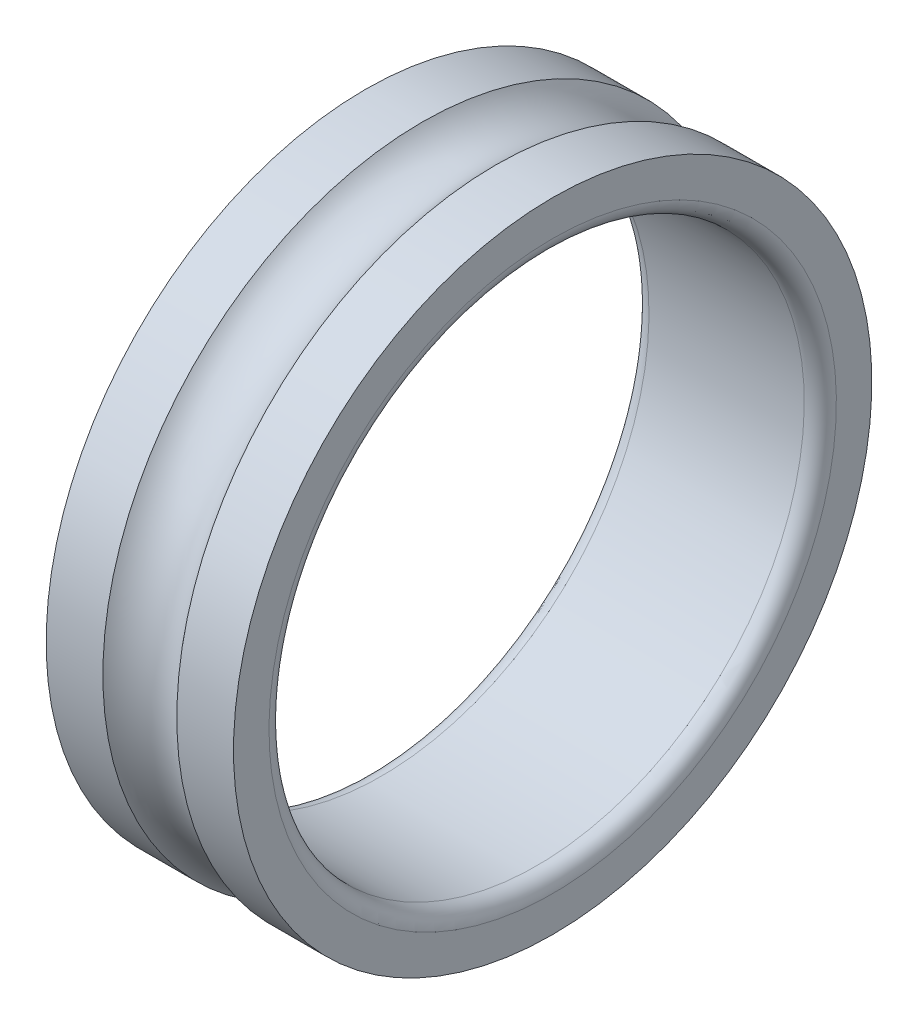
ISO-10303-21;
HEADER;
FILE_DESCRIPTION(('STEP AP214'),'2;1');
FILE_NAME('part.step','',(''),(''),'','','');
FILE_SCHEMA(('AUTOMOTIVE_DESIGN { 1 0 10303 214 1 1 1 1 }'));
ENDSEC;
DATA;
#1=APPLICATION_CONTEXT('core data for automotive mechanical design processes');
#2=APPLICATION_PROTOCOL_DEFINITION('international standard','automotive_design',2000,#1);
#3=PRODUCT_CONTEXT('',#1,'mechanical');
#4=PRODUCT('Part','Part','',(#3));
#5=PRODUCT_RELATED_PRODUCT_CATEGORY('part','',(#4));
#6=PRODUCT_DEFINITION_FORMATION('','',#4);
#7=PRODUCT_DEFINITION_CONTEXT('part definition',#1,'design');
#8=PRODUCT_DEFINITION('design','',#6,#7);
#9=PRODUCT_DEFINITION_SHAPE('','',#8);
#10=(LENGTH_UNIT() NAMED_UNIT(*) SI_UNIT(.MILLI.,.METRE.));
#11=(NAMED_UNIT(*) PLANE_ANGLE_UNIT() SI_UNIT($,.RADIAN.));
#12=(NAMED_UNIT(*) SI_UNIT($,.STERADIAN.) SOLID_ANGLE_UNIT());
#13=UNCERTAINTY_MEASURE_WITH_UNIT(LENGTH_MEASURE(1.E-05),#10,'distance_accuracy_value','');
#14=(GEOMETRIC_REPRESENTATION_CONTEXT(3) GLOBAL_UNCERTAINTY_ASSIGNED_CONTEXT((#13)) GLOBAL_UNIT_ASSIGNED_CONTEXT((#10,
#11,#12)) REPRESENTATION_CONTEXT('',''));
#15=CARTESIAN_POINT('',(0.,0.,0.));
#16=DIRECTION('',(0.,0.,1.));
#17=DIRECTION('',(1.,0.,0.));
#18=AXIS2_PLACEMENT_3D('',#15,#16,#17);
#19=CARTESIAN_POINT('',(5.94044822398207,0.,0.));
#20=DIRECTION('',(-1.,0.,0.));
#21=DIRECTION('',(0.,1.,0.));
#22=AXIS2_PLACEMENT_3D('',#19,#20,#21);
#23=CYLINDRICAL_SURFACE('',#22,11.925);
#24=CARTESIAN_POINT('',(4.88089644796414,0.,0.));
#25=DIRECTION('',(1.,0.,0.));
#26=DIRECTION('',(0.,1.,0.));
#27=AXIS2_PLACEMENT_3D('',#24,#25,#26);
#28=CIRCLE('',#27,11.925);
#29=CARTESIAN_POINT('',(4.88089644796414,11.925,0.));
#30=VERTEX_POINT('',#29);
#31=EDGE_CURVE('E11',#30,#30,#28,.T.);
#32=ORIENTED_EDGE('',*,*,#31,.T.);
#33=EDGE_LOOP('',(#32));
#34=FACE_BOUND('',#33,.T.);
#35=CARTESIAN_POINT('',(7.,0.,0.));
#36=DIRECTION('',(1.,0.,0.));
#37=DIRECTION('',(0.,1.,0.));
#38=AXIS2_PLACEMENT_3D('',#35,#36,#37);
#39=CIRCLE('',#38,11.925);
#40=CARTESIAN_POINT('',(7.,11.925,0.));
#41=VERTEX_POINT('',#40);
#42=EDGE_CURVE('E60',#41,#41,#39,.T.);
#43=ORIENTED_EDGE('',*,*,#42,.F.);
#44=EDGE_LOOP('',(#43));
#45=FACE_BOUND('',#44,.T.);
#46=ADVANCED_FACE('F16',(#34,#45),#23,.T.);
#47=CARTESIAN_POINT('',(3.5,0.,0.));
#48=DIRECTION('',(1.,0.,0.));
#49=DIRECTION('',(0.,0.,-1.));
#50=AXIS2_PLACEMENT_3D('',#47,#48,#49);
#51=TOROIDAL_SURFACE('',#50,13.,1.75);
#52=CARTESIAN_POINT('',(2.11910355203586,0.,0.));
#53=DIRECTION('',(1.,0.,0.));
#54=DIRECTION('',(0.,1.,0.));
#55=AXIS2_PLACEMENT_3D('',#52,#53,#54);
#56=CIRCLE('',#55,11.925);
#57=CARTESIAN_POINT('',(2.11910355203586,11.925,0.));
#58=VERTEX_POINT('',#57);
#59=EDGE_CURVE('E25',#58,#58,#56,.T.);
#60=ORIENTED_EDGE('',*,*,#59,.T.);
#61=EDGE_LOOP('',(#60));
#62=FACE_BOUND('',#61,.T.);
#63=ORIENTED_EDGE('',*,*,#31,.F.);
#64=EDGE_LOOP('',(#63));
#65=FACE_BOUND('',#64,.T.);
#66=ADVANCED_FACE('F86',(#62,#65),#51,.F.);
#67=CARTESIAN_POINT('',(1.05955177601793,0.,0.));
#68=DIRECTION('',(-1.,0.,0.));
#69=DIRECTION('',(0.,1.,0.));
#70=AXIS2_PLACEMENT_3D('',#67,#68,#69);
#71=CYLINDRICAL_SURFACE('',#70,11.925);
#72=CARTESIAN_POINT('',(0.,0.,0.));
#73=DIRECTION('',(1.,0.,0.));
#74=DIRECTION('',(0.,1.,0.));
#75=AXIS2_PLACEMENT_3D('',#72,#73,#74);
#76=CIRCLE('',#75,11.925);
#77=CARTESIAN_POINT('',(0.,11.925,0.));
#78=VERTEX_POINT('',#77);
#79=EDGE_CURVE('E58',#78,#78,#76,.T.);
#80=ORIENTED_EDGE('',*,*,#79,.T.);
#81=EDGE_LOOP('',(#80));
#82=FACE_BOUND('',#81,.T.);
#83=ORIENTED_EDGE('',*,*,#59,.F.);
#84=EDGE_LOOP('',(#83));
#85=FACE_BOUND('',#84,.T.);
#86=ADVANCED_FACE('F91',(#82,#85),#71,.T.);
#87=CARTESIAN_POINT('',(0.,11.2625,0.));
#88=DIRECTION('',(-1.,0.,0.));
#89=DIRECTION('',(0.,-1.,0.));
#90=AXIS2_PLACEMENT_3D('',#87,#88,#89);
#91=PLANE('',#90);
#92=CARTESIAN_POINT('',(0.,0.,0.));
#93=DIRECTION('',(1.,0.,0.));
#94=DIRECTION('',(0.,1.,0.));
#95=AXIS2_PLACEMENT_3D('',#92,#93,#94);
#96=CIRCLE('',#95,10.6);
#97=CARTESIAN_POINT('',(0.,10.6,0.));
#98=VERTEX_POINT('',#97);
#99=EDGE_CURVE('E56',#98,#98,#96,.T.);
#100=ORIENTED_EDGE('',*,*,#99,.T.);
#101=EDGE_LOOP('',(#100));
#102=FACE_BOUND('',#101,.T.);
#103=ORIENTED_EDGE('',*,*,#79,.F.);
#104=EDGE_LOOP('',(#103));
#105=FACE_BOUND('',#104,.T.);
#106=ADVANCED_FACE('F18',(#102,#105),#91,.T.);
#107=CARTESIAN_POINT('',(0.6,0.,0.));
#108=DIRECTION('',(1.,0.,0.));
#109=DIRECTION('',(0.,0.,-1.));
#110=AXIS2_PLACEMENT_3D('',#107,#108,#109);
#111=TOROIDAL_SURFACE('',#110,10.6,0.6);
#112=CARTESIAN_POINT('',(0.6,0.,0.));
#113=DIRECTION('',(1.,0.,0.));
#114=DIRECTION('',(0.,1.,0.));
#115=AXIS2_PLACEMENT_3D('',#112,#113,#114);
#116=CIRCLE('',#115,10.);
#117=CARTESIAN_POINT('',(0.6,10.,0.));
#118=VERTEX_POINT('',#117);
#119=EDGE_CURVE('E20',#118,#118,#116,.T.);
#120=ORIENTED_EDGE('',*,*,#119,.T.);
#121=EDGE_LOOP('',(#120));
#122=FACE_BOUND('',#121,.T.);
#123=ORIENTED_EDGE('',*,*,#99,.F.);
#124=EDGE_LOOP('',(#123));
#125=FACE_BOUND('',#124,.T.);
#126=ADVANCED_FACE('F53',(#122,#125),#111,.T.);
#127=CARTESIAN_POINT('',(3.5,0.,0.));
#128=DIRECTION('',(-1.,0.,0.));
#129=DIRECTION('',(0.,1.,0.));
#130=AXIS2_PLACEMENT_3D('',#127,#128,#129);
#131=CYLINDRICAL_SURFACE('',#130,10.);
#132=CARTESIAN_POINT('',(6.4,0.,0.));
#133=DIRECTION('',(1.,0.,0.));
#134=DIRECTION('',(0.,1.,0.));
#135=AXIS2_PLACEMENT_3D('',#132,#133,#134);
#136=CIRCLE('',#135,10.);
#137=CARTESIAN_POINT('',(6.4,10.,0.));
#138=VERTEX_POINT('',#137);
#139=EDGE_CURVE('E57',#138,#138,#136,.T.);
#140=ORIENTED_EDGE('',*,*,#139,.T.);
#141=EDGE_LOOP('',(#140));
#142=FACE_BOUND('',#141,.T.);
#143=ORIENTED_EDGE('',*,*,#119,.F.);
#144=EDGE_LOOP('',(#143));
#145=FACE_BOUND('',#144,.T.);
#146=ADVANCED_FACE('F81',(#142,#145),#131,.F.);
#147=CARTESIAN_POINT('',(6.4,0.,0.));
#148=DIRECTION('',(1.,0.,0.));
#149=DIRECTION('',(0.,0.,-1.));
#150=AXIS2_PLACEMENT_3D('',#147,#148,#149);
#151=TOROIDAL_SURFACE('',#150,10.6,0.6);
#152=CARTESIAN_POINT('',(7.,0.,0.));
#153=DIRECTION('',(1.,0.,0.));
#154=DIRECTION('',(0.,1.,0.));
#155=AXIS2_PLACEMENT_3D('',#152,#153,#154);
#156=CIRCLE('',#155,10.6);
#157=CARTESIAN_POINT('',(7.,10.6,0.));
#158=VERTEX_POINT('',#157);
#159=EDGE_CURVE('E64',#158,#158,#156,.T.);
#160=ORIENTED_EDGE('',*,*,#159,.T.);
#161=EDGE_LOOP('',(#160));
#162=FACE_BOUND('',#161,.T.);
#163=ORIENTED_EDGE('',*,*,#139,.F.);
#164=EDGE_LOOP('',(#163));
#165=FACE_BOUND('',#164,.T.);
#166=ADVANCED_FACE('F70',(#162,#165),#151,.T.);
#167=CARTESIAN_POINT('',(7.,11.2625,0.));
#168=DIRECTION('',(1.,0.,0.));
#169=DIRECTION('',(0.,1.,0.));
#170=AXIS2_PLACEMENT_3D('',#167,#168,#169);
#171=PLANE('',#170);
#172=ORIENTED_EDGE('',*,*,#42,.T.);
#173=EDGE_LOOP('',(#172));
#174=FACE_BOUND('',#173,.T.);
#175=ORIENTED_EDGE('',*,*,#159,.F.);
#176=EDGE_LOOP('',(#175));
#177=FACE_BOUND('',#176,.T.);
#178=ADVANCED_FACE('F73',(#174,#177),#171,.T.);
#179=CLOSED_SHELL('',(#46,#66,#86,#106,#126,#146,#166,#178));
#180=MANIFOLD_SOLID_BREP('B1',#179);
#181=ADVANCED_BREP_SHAPE_REPRESENTATION('',(#18,#180),#14);
#182=SHAPE_DEFINITION_REPRESENTATION(#9,#181);
ENDSEC;
END-ISO-10303-21;
